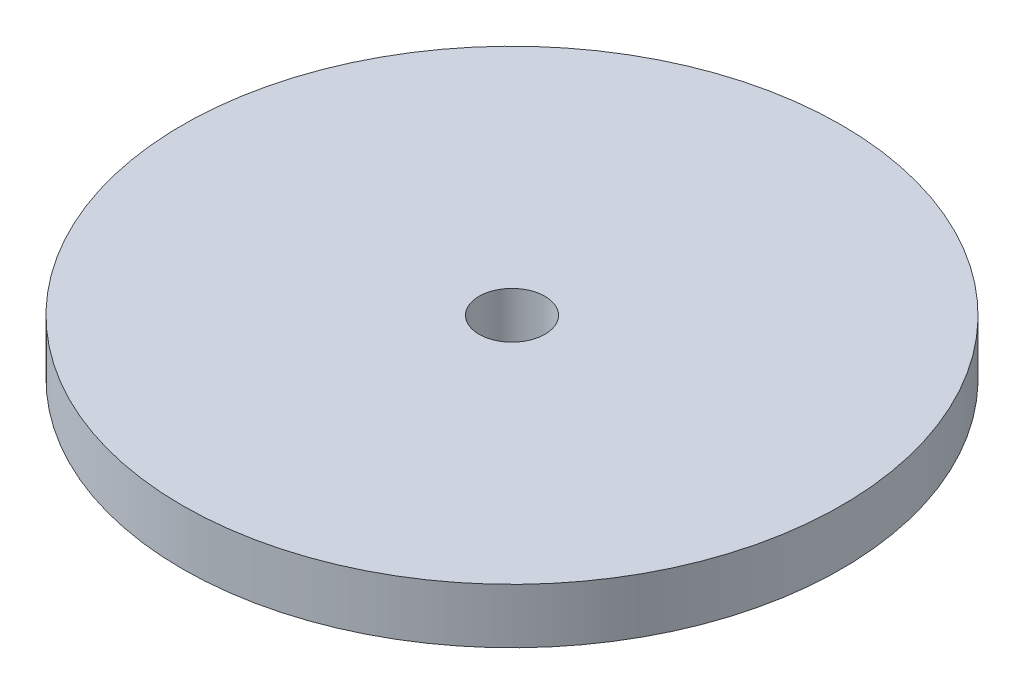
ISO-10303-21;
HEADER;
FILE_DESCRIPTION(('STEP AP214'),'2;1');
FILE_NAME('part.step','',(''),(''),'','','');
FILE_SCHEMA(('AUTOMOTIVE_DESIGN { 1 0 10303 214 1 1 1 1 }'));
ENDSEC;
DATA;
#1=APPLICATION_CONTEXT('core data for automotive mechanical design processes');
#2=APPLICATION_PROTOCOL_DEFINITION('international standard','automotive_design',2000,#1);
#3=PRODUCT_CONTEXT('',#1,'mechanical');
#4=PRODUCT('Part','Part','',(#3));
#5=PRODUCT_RELATED_PRODUCT_CATEGORY('part','',(#4));
#6=PRODUCT_DEFINITION_FORMATION('','',#4);
#7=PRODUCT_DEFINITION_CONTEXT('part definition',#1,'design');
#8=PRODUCT_DEFINITION('design','',#6,#7);
#9=PRODUCT_DEFINITION_SHAPE('','',#8);
#10=(LENGTH_UNIT() NAMED_UNIT(*) SI_UNIT(.MILLI.,.METRE.));
#11=(NAMED_UNIT(*) PLANE_ANGLE_UNIT() SI_UNIT($,.RADIAN.));
#12=(NAMED_UNIT(*) SI_UNIT($,.STERADIAN.) SOLID_ANGLE_UNIT());
#13=UNCERTAINTY_MEASURE_WITH_UNIT(LENGTH_MEASURE(1.E-05),#10,'distance_accuracy_value','');
#14=(GEOMETRIC_REPRESENTATION_CONTEXT(3) GLOBAL_UNCERTAINTY_ASSIGNED_CONTEXT((#13)) GLOBAL_UNIT_ASSIGNED_CONTEXT((#10,
#11,#12)) REPRESENTATION_CONTEXT('',''));
#15=CARTESIAN_POINT('',(0.,0.,0.));
#16=DIRECTION('',(0.,0.,1.));
#17=DIRECTION('',(1.,0.,0.));
#18=AXIS2_PLACEMENT_3D('',#15,#16,#17);
#19=CARTESIAN_POINT('',(0.,5.,0.));
#20=DIRECTION('',(0.,1.,0.));
#21=DIRECTION('',(0.,0.,1.));
#22=AXIS2_PLACEMENT_3D('',#19,#20,#21);
#23=PLANE('',#22);
#24=CARTESIAN_POINT('',(0.,5.,0.));
#25=DIRECTION('',(0.,1.,0.));
#26=DIRECTION('',(0.,0.,1.));
#27=AXIS2_PLACEMENT_3D('',#24,#25,#26);
#28=CIRCLE('',#27,30.);
#29=CARTESIAN_POINT('',(0.,5.,30.));
#30=VERTEX_POINT('',#29);
#31=EDGE_CURVE('E10',#30,#30,#28,.T.);
#32=ORIENTED_EDGE('',*,*,#31,.T.);
#33=EDGE_LOOP('',(#32));
#34=FACE_BOUND('',#33,.T.);
#35=CARTESIAN_POINT('',(0.,5.,0.));
#36=DIRECTION('',(0.,1.,0.));
#37=DIRECTION('',(0.,0.,1.));
#38=AXIS2_PLACEMENT_3D('',#35,#36,#37);
#39=CIRCLE('',#38,3.);
#40=CARTESIAN_POINT('',(0.,5.,3.));
#41=VERTEX_POINT('',#40);
#42=EDGE_CURVE('E44',#41,#41,#39,.T.);
#43=ORIENTED_EDGE('',*,*,#42,.F.);
#44=EDGE_LOOP('',(#43));
#45=FACE_BOUND('',#44,.T.);
#46=ADVANCED_FACE('F33',(#34,#45),#23,.T.);
#47=CARTESIAN_POINT('',(0.,0.,0.));
#48=DIRECTION('',(0.,1.,0.));
#49=DIRECTION('',(0.,0.,1.));
#50=AXIS2_PLACEMENT_3D('',#47,#48,#49);
#51=PLANE('',#50);
#52=CARTESIAN_POINT('',(0.,0.,0.));
#53=DIRECTION('',(0.,1.,0.));
#54=DIRECTION('',(0.,0.,1.));
#55=AXIS2_PLACEMENT_3D('',#52,#53,#54);
#56=CIRCLE('',#55,30.);
#57=CARTESIAN_POINT('',(0.,0.,30.));
#58=VERTEX_POINT('',#57);
#59=EDGE_CURVE('E37',#58,#58,#56,.T.);
#60=ORIENTED_EDGE('',*,*,#59,.F.);
#61=EDGE_LOOP('',(#60));
#62=FACE_BOUND('',#61,.T.);
#63=CARTESIAN_POINT('',(0.,0.,0.));
#64=DIRECTION('',(0.,1.,0.));
#65=DIRECTION('',(0.,0.,1.));
#66=AXIS2_PLACEMENT_3D('',#63,#64,#65);
#67=CIRCLE('',#66,3.);
#68=CARTESIAN_POINT('',(0.,0.,3.));
#69=VERTEX_POINT('',#68);
#70=EDGE_CURVE('E46',#69,#69,#67,.T.);
#71=ORIENTED_EDGE('',*,*,#70,.T.);
#72=EDGE_LOOP('',(#71));
#73=FACE_BOUND('',#72,.T.);
#74=ADVANCED_FACE('F56',(#62,#73),#51,.F.);
#75=CARTESIAN_POINT('',(0.,5.,0.));
#76=DIRECTION('',(0.,-1.,0.));
#77=DIRECTION('',(0.,0.,-1.));
#78=AXIS2_PLACEMENT_3D('',#75,#76,#77);
#79=CYLINDRICAL_SURFACE('',#78,30.);
#80=ORIENTED_EDGE('',*,*,#31,.F.);
#81=EDGE_LOOP('',(#80));
#82=FACE_BOUND('',#81,.T.);
#83=ORIENTED_EDGE('',*,*,#59,.T.);
#84=EDGE_LOOP('',(#83));
#85=FACE_BOUND('',#84,.T.);
#86=ADVANCED_FACE('F35',(#82,#85),#79,.T.);
#87=CARTESIAN_POINT('',(0.,5.,0.));
#88=DIRECTION('',(0.,-1.,0.));
#89=DIRECTION('',(0.,0.,-1.));
#90=AXIS2_PLACEMENT_3D('',#87,#88,#89);
#91=CYLINDRICAL_SURFACE('',#90,3.);
#92=ORIENTED_EDGE('',*,*,#42,.T.);
#93=EDGE_LOOP('',(#92));
#94=FACE_BOUND('',#93,.T.);
#95=ORIENTED_EDGE('',*,*,#70,.F.);
#96=EDGE_LOOP('',(#95));
#97=FACE_BOUND('',#96,.T.);
#98=ADVANCED_FACE('F52',(#94,#97),#91,.F.);
#99=CLOSED_SHELL('',(#46,#74,#86,#98));
#100=MANIFOLD_SOLID_BREP('B2',#99);
#101=ADVANCED_BREP_SHAPE_REPRESENTATION('',(#18,#100),#14);
#102=SHAPE_DEFINITION_REPRESENTATION(#9,#101);
ENDSEC;
END-ISO-10303-21;
